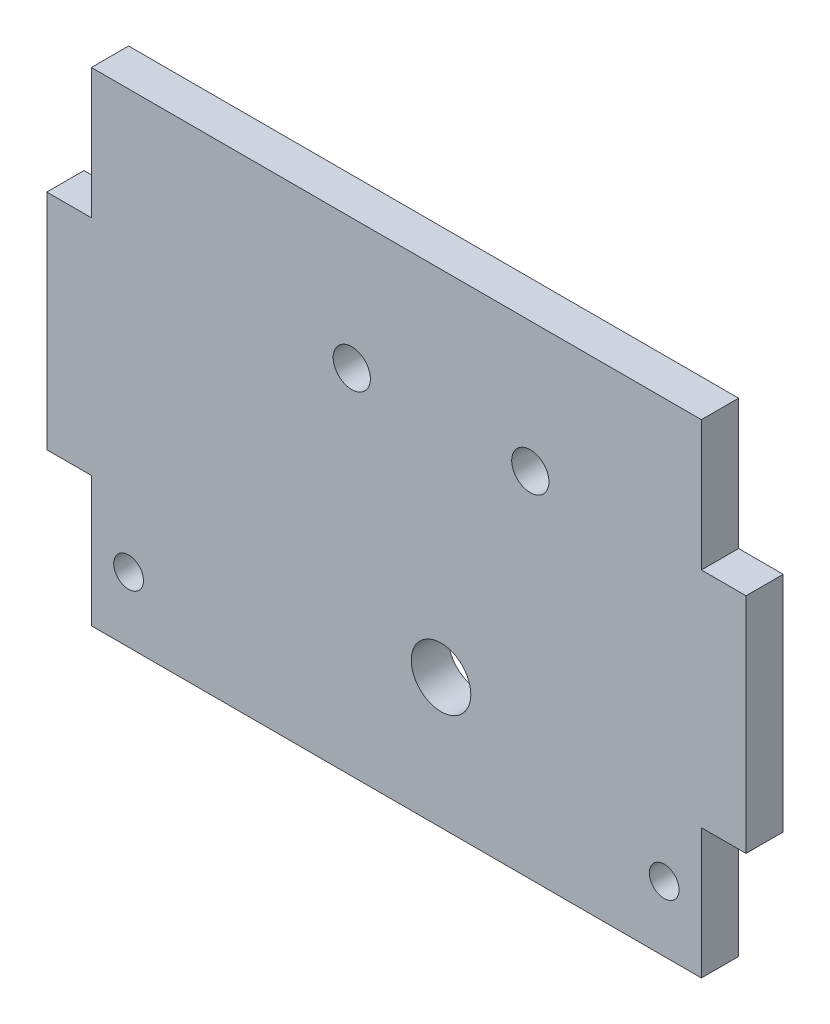
ISO-10303-21;
HEADER;
FILE_DESCRIPTION(('STEP AP214'),'2;1');
FILE_NAME('part.step','',(''),(''),'','','');
FILE_SCHEMA(('AUTOMOTIVE_DESIGN { 1 0 10303 214 1 1 1 1 }'));
ENDSEC;
DATA;
#1=APPLICATION_CONTEXT('core data for automotive mechanical design processes');
#2=APPLICATION_PROTOCOL_DEFINITION('international standard','automotive_design',2000,#1);
#3=PRODUCT_CONTEXT('',#1,'mechanical');
#4=PRODUCT('Part','Part','',(#3));
#5=PRODUCT_RELATED_PRODUCT_CATEGORY('part','',(#4));
#6=PRODUCT_DEFINITION_FORMATION('','',#4);
#7=PRODUCT_DEFINITION_CONTEXT('part definition',#1,'design');
#8=PRODUCT_DEFINITION('design','',#6,#7);
#9=PRODUCT_DEFINITION_SHAPE('','',#8);
#10=(LENGTH_UNIT() NAMED_UNIT(*) SI_UNIT(.MILLI.,.METRE.));
#11=(NAMED_UNIT(*) PLANE_ANGLE_UNIT() SI_UNIT($,.RADIAN.));
#12=(NAMED_UNIT(*) SI_UNIT($,.STERADIAN.) SOLID_ANGLE_UNIT());
#13=UNCERTAINTY_MEASURE_WITH_UNIT(LENGTH_MEASURE(1.E-05),#10,'distance_accuracy_value','');
#14=(GEOMETRIC_REPRESENTATION_CONTEXT(3) GLOBAL_UNCERTAINTY_ASSIGNED_CONTEXT((#13)) GLOBAL_UNIT_ASSIGNED_CONTEXT((#10,
#11,#12)) REPRESENTATION_CONTEXT('',''));
#15=CARTESIAN_POINT('',(0.,0.,0.));
#16=DIRECTION('',(0.,0.,1.));
#17=DIRECTION('',(1.,0.,0.));
#18=AXIS2_PLACEMENT_3D('',#15,#16,#17);
#19=CARTESIAN_POINT('',(0.,0.,5.));
#20=DIRECTION('',(0.,0.,-1.));
#21=DIRECTION('',(-1.,0.,0.));
#22=AXIS2_PLACEMENT_3D('',#19,#20,#21);
#23=PLANE('',#22);
#24=CARTESIAN_POINT('',(13.,47.5,5.));
#25=DIRECTION('',(0.,0.,1.));
#26=DIRECTION('',(1.,0.,0.));
#27=AXIS2_PLACEMENT_3D('',#24,#25,#26);
#28=CIRCLE('',#27,2.5);
#29=CARTESIAN_POINT('',(15.5,47.5,5.));
#30=VERTEX_POINT('',#29);
#31=EDGE_CURVE('E218',#30,#30,#28,.T.);
#32=ORIENTED_EDGE('',*,*,#31,.F.);
#33=EDGE_LOOP('',(#32));
#34=FACE_BOUND('',#33,.T.);
#35=CARTESIAN_POINT('',(37.,47.5,5.));
#36=DIRECTION('',(0.,0.,1.));
#37=DIRECTION('',(1.,0.,0.));
#38=AXIS2_PLACEMENT_3D('',#35,#36,#37);
#39=CIRCLE('',#38,2.5);
#40=CARTESIAN_POINT('',(39.5,47.5,5.));
#41=VERTEX_POINT('',#40);
#42=EDGE_CURVE('E223',#41,#41,#39,.T.);
#43=ORIENTED_EDGE('',*,*,#42,.F.);
#44=EDGE_LOOP('',(#43));
#45=FACE_BOUND('',#44,.T.);
#46=CARTESIAN_POINT('',(55.,8.74999999999999,5.));
#47=DIRECTION('',(0.,0.,1.));
#48=DIRECTION('',(1.,0.,0.));
#49=AXIS2_PLACEMENT_3D('',#46,#47,#48);
#50=CIRCLE('',#49,2.);
#51=CARTESIAN_POINT('',(57.,8.74999999999999,5.));
#52=VERTEX_POINT('',#51);
#53=EDGE_CURVE('E215',#52,#52,#50,.T.);
#54=ORIENTED_EDGE('',*,*,#53,.F.);
#55=EDGE_LOOP('',(#54));
#56=FACE_BOUND('',#55,.T.);
#57=DIRECTION('',(0.,-1.,0.));
#58=VECTOR('',#57,1.);
#59=CARTESIAN_POINT('',(60.,75.,5.));
#60=LINE('',#59,#58);
#61=CARTESIAN_POINT('',(60.,65.,5.));
#62=VERTEX_POINT('',#61);
#63=CARTESIAN_POINT('',(60.,47.5,5.));
#64=VERTEX_POINT('',#63);
#65=EDGE_CURVE('E154',#62,#64,#60,.T.);
#66=ORIENTED_EDGE('',*,*,#65,.F.);
#67=DIRECTION('',(1.,0.,0.));
#68=VECTOR('',#67,1.);
#69=CARTESIAN_POINT('',(60.,65.,5.));
#70=LINE('',#69,#68);
#71=CARTESIAN_POINT('',(-22.,65.,5.));
#72=VERTEX_POINT('',#71);
#73=EDGE_CURVE('E54',#72,#62,#70,.T.);
#74=ORIENTED_EDGE('',*,*,#73,.F.);
#75=DIRECTION('',(0.,-1.,0.));
#76=VECTOR('',#75,1.);
#77=CARTESIAN_POINT('',(-22.,65.,5.));
#78=LINE('',#77,#76);
#79=CARTESIAN_POINT('',(-22.,47.5,5.));
#80=VERTEX_POINT('',#79);
#81=EDGE_CURVE('E61',#72,#80,#78,.T.);
#82=ORIENTED_EDGE('',*,*,#81,.T.);
#83=DIRECTION('',(1.,0.,0.));
#84=VECTOR('',#83,1.);
#85=CARTESIAN_POINT('',(0.,47.5,5.));
#86=LINE('',#85,#84);
#87=CARTESIAN_POINT('',(-28.,47.5,5.));
#88=VERTEX_POINT('',#87);
#89=EDGE_CURVE('E179',#88,#80,#86,.T.);
#90=ORIENTED_EDGE('',*,*,#89,.F.);
#91=DIRECTION('',(0.,1.,0.));
#92=VECTOR('',#91,1.);
#93=CARTESIAN_POINT('',(-28.,0.,5.));
#94=LINE('',#93,#92);
#95=CARTESIAN_POINT('',(-28.,17.5,5.));
#96=VERTEX_POINT('',#95);
#97=EDGE_CURVE('E175',#96,#88,#94,.T.);
#98=ORIENTED_EDGE('',*,*,#97,.F.);
#99=DIRECTION('',(-1.,0.,0.));
#100=VECTOR('',#99,1.);
#101=CARTESIAN_POINT('',(0.,17.5,5.));
#102=LINE('',#101,#100);
#103=CARTESIAN_POINT('',(-22.,17.5,5.));
#104=VERTEX_POINT('',#103);
#105=EDGE_CURVE('E170',#104,#96,#102,.T.);
#106=ORIENTED_EDGE('',*,*,#105,.F.);
#107=CARTESIAN_POINT('',(-22.,0.,5.));
#108=VERTEX_POINT('',#107);
#109=EDGE_CURVE('E187',#104,#108,#78,.T.);
#110=ORIENTED_EDGE('',*,*,#109,.T.);
#111=DIRECTION('',(1.,0.,0.));
#112=VECTOR('',#111,1.);
#113=CARTESIAN_POINT('',(0.,0.,5.));
#114=LINE('',#113,#112);
#115=CARTESIAN_POINT('',(60.,0.,5.));
#116=VERTEX_POINT('',#115);
#117=EDGE_CURVE('E11',#108,#116,#114,.T.);
#118=ORIENTED_EDGE('',*,*,#117,.T.);
#119=DIRECTION('',(0.,-1.,0.));
#120=VECTOR('',#119,1.);
#121=CARTESIAN_POINT('',(60.,17.5,5.));
#122=LINE('',#121,#120);
#123=CARTESIAN_POINT('',(60.,17.5,5.));
#124=VERTEX_POINT('',#123);
#125=EDGE_CURVE('E149',#124,#116,#122,.T.);
#126=ORIENTED_EDGE('',*,*,#125,.F.);
#127=DIRECTION('',(-1.,0.,0.));
#128=VECTOR('',#127,1.);
#129=CARTESIAN_POINT('',(66.,17.5,5.));
#130=LINE('',#129,#128);
#131=CARTESIAN_POINT('',(66.,17.5,5.));
#132=VERTEX_POINT('',#131);
#133=EDGE_CURVE('E250',#132,#124,#130,.T.);
#134=ORIENTED_EDGE('',*,*,#133,.F.);
#135=DIRECTION('',(0.,-1.,0.));
#136=VECTOR('',#135,1.);
#137=CARTESIAN_POINT('',(66.,47.5,5.));
#138=LINE('',#137,#136);
#139=CARTESIAN_POINT('',(66.,47.5,5.));
#140=VERTEX_POINT('',#139);
#141=EDGE_CURVE('E214',#140,#132,#138,.T.);
#142=ORIENTED_EDGE('',*,*,#141,.F.);
#143=DIRECTION('',(-1.,0.,0.));
#144=VECTOR('',#143,1.);
#145=CARTESIAN_POINT('',(66.,47.5,5.));
#146=LINE('',#145,#144);
#147=EDGE_CURVE('E242',#140,#64,#146,.T.);
#148=ORIENTED_EDGE('',*,*,#147,.T.);
#149=EDGE_LOOP('',(#66,#74,#82,#90,#98,#106,#110,#118,#126,#134,#142,#148));
#150=FACE_BOUND('',#149,.T.);
#151=CARTESIAN_POINT('',(-17.,8.75,5.));
#152=DIRECTION('',(0.,0.,1.));
#153=DIRECTION('',(1.,0.,0.));
#154=AXIS2_PLACEMENT_3D('',#151,#152,#153);
#155=CIRCLE('',#154,2.);
#156=CARTESIAN_POINT('',(-15.,8.75,5.));
#157=VERTEX_POINT('',#156);
#158=EDGE_CURVE('E166',#157,#157,#155,.T.);
#159=ORIENTED_EDGE('',*,*,#158,.F.);
#160=EDGE_LOOP('',(#159));
#161=FACE_BOUND('',#160,.T.);
#162=CARTESIAN_POINT('',(25.,17.5,5.));
#163=DIRECTION('',(0.,0.,1.));
#164=DIRECTION('',(1.,0.,0.));
#165=AXIS2_PLACEMENT_3D('',#162,#163,#164);
#166=CIRCLE('',#165,4.);
#167=CARTESIAN_POINT('',(29.,17.5,5.));
#168=VERTEX_POINT('',#167);
#169=EDGE_CURVE('E204',#168,#168,#166,.T.);
#170=ORIENTED_EDGE('',*,*,#169,.F.);
#171=EDGE_LOOP('',(#170));
#172=FACE_BOUND('',#171,.T.);
#173=ADVANCED_FACE('F37',(#34,#45,#56,#150,#161,#172),#23,.F.);
#174=CARTESIAN_POINT('',(0.,0.,0.));
#175=DIRECTION('',(0.,0.,-1.));
#176=DIRECTION('',(-1.,0.,0.));
#177=AXIS2_PLACEMENT_3D('',#174,#175,#176);
#178=PLANE('',#177);
#179=CARTESIAN_POINT('',(13.,47.5,0.));
#180=DIRECTION('',(0.,0.,-1.));
#181=DIRECTION('',(-1.,0.,0.));
#182=AXIS2_PLACEMENT_3D('',#179,#180,#181);
#183=CIRCLE('',#182,2.5);
#184=CARTESIAN_POINT('',(10.5,47.5,0.));
#185=VERTEX_POINT('',#184);
#186=EDGE_CURVE('E41',#185,#185,#183,.T.);
#187=ORIENTED_EDGE('',*,*,#186,.F.);
#188=EDGE_LOOP('',(#187));
#189=FACE_BOUND('',#188,.T.);
#190=CARTESIAN_POINT('',(37.,47.5,0.));
#191=DIRECTION('',(0.,0.,-1.));
#192=DIRECTION('',(-1.,0.,0.));
#193=AXIS2_PLACEMENT_3D('',#190,#191,#192);
#194=CIRCLE('',#193,2.5);
#195=CARTESIAN_POINT('',(34.5,47.5,0.));
#196=VERTEX_POINT('',#195);
#197=EDGE_CURVE('E216',#196,#196,#194,.T.);
#198=ORIENTED_EDGE('',*,*,#197,.F.);
#199=EDGE_LOOP('',(#198));
#200=FACE_BOUND('',#199,.T.);
#201=DIRECTION('',(-1.,0.,0.));
#202=VECTOR('',#201,1.);
#203=CARTESIAN_POINT('',(60.,65.,0.));
#204=LINE('',#203,#202);
#205=CARTESIAN_POINT('',(60.,65.,0.));
#206=VERTEX_POINT('',#205);
#207=CARTESIAN_POINT('',(-22.,65.,0.));
#208=VERTEX_POINT('',#207);
#209=EDGE_CURVE('E128',#206,#208,#204,.T.);
#210=ORIENTED_EDGE('',*,*,#209,.F.);
#211=DIRECTION('',(0.,1.,0.));
#212=VECTOR('',#211,1.);
#213=CARTESIAN_POINT('',(60.,75.,0.));
#214=LINE('',#213,#212);
#215=CARTESIAN_POINT('',(60.,47.5,0.));
#216=VERTEX_POINT('',#215);
#217=EDGE_CURVE('E140',#216,#206,#214,.T.);
#218=ORIENTED_EDGE('',*,*,#217,.F.);
#219=DIRECTION('',(-1.,0.,0.));
#220=VECTOR('',#219,1.);
#221=CARTESIAN_POINT('',(66.,47.5,0.));
#222=LINE('',#221,#220);
#223=CARTESIAN_POINT('',(66.,47.5,0.));
#224=VERTEX_POINT('',#223);
#225=EDGE_CURVE('E245',#224,#216,#222,.T.);
#226=ORIENTED_EDGE('',*,*,#225,.F.);
#227=DIRECTION('',(0.,1.,0.));
#228=VECTOR('',#227,1.);
#229=CARTESIAN_POINT('',(66.,47.5,0.));
#230=LINE('',#229,#228);
#231=CARTESIAN_POINT('',(66.,17.5,0.));
#232=VERTEX_POINT('',#231);
#233=EDGE_CURVE('E238',#232,#224,#230,.T.);
#234=ORIENTED_EDGE('',*,*,#233,.F.);
#235=DIRECTION('',(-1.,0.,0.));
#236=VECTOR('',#235,1.);
#237=CARTESIAN_POINT('',(66.,17.5,0.));
#238=LINE('',#237,#236);
#239=CARTESIAN_POINT('',(60.,17.5,0.));
#240=VERTEX_POINT('',#239);
#241=EDGE_CURVE('E247',#232,#240,#238,.T.);
#242=ORIENTED_EDGE('',*,*,#241,.T.);
#243=DIRECTION('',(0.,1.,0.));
#244=VECTOR('',#243,1.);
#245=CARTESIAN_POINT('',(60.,17.5,0.));
#246=LINE('',#245,#244);
#247=CARTESIAN_POINT('',(60.,0.,0.));
#248=VERTEX_POINT('',#247);
#249=EDGE_CURVE('E160',#248,#240,#246,.T.);
#250=ORIENTED_EDGE('',*,*,#249,.F.);
#251=DIRECTION('',(1.,0.,0.));
#252=VECTOR('',#251,1.);
#253=CARTESIAN_POINT('',(0.,0.,0.));
#254=LINE('',#253,#252);
#255=CARTESIAN_POINT('',(-22.,0.,0.));
#256=VERTEX_POINT('',#255);
#257=EDGE_CURVE('E46',#256,#248,#254,.T.);
#258=ORIENTED_EDGE('',*,*,#257,.F.);
#259=DIRECTION('',(0.,-1.,0.));
#260=VECTOR('',#259,1.);
#261=CARTESIAN_POINT('',(-22.,65.,0.));
#262=LINE('',#261,#260);
#263=CARTESIAN_POINT('',(-22.,17.5,0.));
#264=VERTEX_POINT('',#263);
#265=EDGE_CURVE('E198',#264,#256,#262,.T.);
#266=ORIENTED_EDGE('',*,*,#265,.F.);
#267=DIRECTION('',(-1.,0.,0.));
#268=VECTOR('',#267,1.);
#269=CARTESIAN_POINT('',(0.,17.5,0.));
#270=LINE('',#269,#268);
#271=CARTESIAN_POINT('',(-28.,17.5,0.));
#272=VERTEX_POINT('',#271);
#273=EDGE_CURVE('E184',#264,#272,#270,.T.);
#274=ORIENTED_EDGE('',*,*,#273,.T.);
#275=DIRECTION('',(0.,1.,0.));
#276=VECTOR('',#275,1.);
#277=CARTESIAN_POINT('',(-28.,0.,0.));
#278=LINE('',#277,#276);
#279=CARTESIAN_POINT('',(-28.,47.5,0.));
#280=VERTEX_POINT('',#279);
#281=EDGE_CURVE('E178',#272,#280,#278,.T.);
#282=ORIENTED_EDGE('',*,*,#281,.T.);
#283=DIRECTION('',(1.,0.,0.));
#284=VECTOR('',#283,1.);
#285=CARTESIAN_POINT('',(0.,47.5,0.));
#286=LINE('',#285,#284);
#287=CARTESIAN_POINT('',(-22.,47.5,0.));
#288=VERTEX_POINT('',#287);
#289=EDGE_CURVE('E188',#280,#288,#286,.T.);
#290=ORIENTED_EDGE('',*,*,#289,.T.);
#291=EDGE_CURVE('E142',#208,#288,#262,.T.);
#292=ORIENTED_EDGE('',*,*,#291,.F.);
#293=EDGE_LOOP('',(#210,#218,#226,#234,#242,#250,#258,#266,#274,#282,#290,#292));
#294=FACE_BOUND('',#293,.T.);
#295=CARTESIAN_POINT('',(55.,8.74999999999999,0.));
#296=DIRECTION('',(0.,0.,-1.));
#297=DIRECTION('',(-1.,0.,0.));
#298=AXIS2_PLACEMENT_3D('',#295,#296,#297);
#299=CIRCLE('',#298,2.);
#300=CARTESIAN_POINT('',(53.,8.74999999999999,0.));
#301=VERTEX_POINT('',#300);
#302=EDGE_CURVE('E212',#301,#301,#299,.T.);
#303=ORIENTED_EDGE('',*,*,#302,.F.);
#304=EDGE_LOOP('',(#303));
#305=FACE_BOUND('',#304,.T.);
#306=CARTESIAN_POINT('',(-17.,8.75,0.));
#307=DIRECTION('',(0.,0.,-1.));
#308=DIRECTION('',(-1.,0.,0.));
#309=AXIS2_PLACEMENT_3D('',#306,#307,#308);
#310=CIRCLE('',#309,2.);
#311=CARTESIAN_POINT('',(-19.,8.75,0.));
#312=VERTEX_POINT('',#311);
#313=EDGE_CURVE('E169',#312,#312,#310,.T.);
#314=ORIENTED_EDGE('',*,*,#313,.F.);
#315=EDGE_LOOP('',(#314));
#316=FACE_BOUND('',#315,.T.);
#317=CARTESIAN_POINT('',(25.,17.5,0.));
#318=DIRECTION('',(0.,0.,1.));
#319=DIRECTION('',(1.,0.,0.));
#320=AXIS2_PLACEMENT_3D('',#317,#318,#319);
#321=CIRCLE('',#320,4.);
#322=CARTESIAN_POINT('',(29.,17.5,0.));
#323=VERTEX_POINT('',#322);
#324=EDGE_CURVE('E203',#323,#323,#321,.T.);
#325=ORIENTED_EDGE('',*,*,#324,.T.);
#326=EDGE_LOOP('',(#325));
#327=FACE_BOUND('',#326,.T.);
#328=ADVANCED_FACE('F137',(#189,#200,#294,#305,#316,#327),#178,.T.);
#329=CARTESIAN_POINT('',(-22.,65.,-65.00769185258));
#330=DIRECTION('',(-1.,0.,0.));
#331=DIRECTION('',(0.,0.,1.));
#332=AXIS2_PLACEMENT_3D('',#329,#330,#331);
#333=PLANE('',#332);
#334=DIRECTION('',(0.,0.,1.));
#335=VECTOR('',#334,1.);
#336=CARTESIAN_POINT('',(-22.,65.,0.));
#337=LINE('',#336,#335);
#338=EDGE_CURVE('E143',#208,#72,#337,.T.);
#339=ORIENTED_EDGE('',*,*,#338,.F.);
#340=ORIENTED_EDGE('',*,*,#291,.T.);
#341=DIRECTION('',(0.,0.,1.));
#342=VECTOR('',#341,1.);
#343=CARTESIAN_POINT('',(-22.,47.5,-30.5941170815567));
#344=LINE('',#343,#342);
#345=EDGE_CURVE('E182',#288,#80,#344,.T.);
#346=ORIENTED_EDGE('',*,*,#345,.T.);
#347=ORIENTED_EDGE('',*,*,#81,.F.);
#348=EDGE_LOOP('',(#339,#340,#346,#347));
#349=FACE_BOUND('',#348,.T.);
#350=ADVANCED_FACE('F287',(#349),#333,.T.);
#351=CARTESIAN_POINT('',(0.,0.,5.));
#352=DIRECTION('',(0.,1.,0.));
#353=DIRECTION('',(0.,0.,1.));
#354=AXIS2_PLACEMENT_3D('',#351,#352,#353);
#355=PLANE('',#354);
#356=ORIENTED_EDGE('',*,*,#257,.T.);
#357=DIRECTION('',(0.,0.,-1.));
#358=VECTOR('',#357,1.);
#359=CARTESIAN_POINT('',(60.,0.,5.));
#360=LINE('',#359,#358);
#361=EDGE_CURVE('E152',#116,#248,#360,.T.);
#362=ORIENTED_EDGE('',*,*,#361,.F.);
#363=ORIENTED_EDGE('',*,*,#117,.F.);
#364=DIRECTION('',(0.,0.,1.));
#365=VECTOR('',#364,1.);
#366=CARTESIAN_POINT('',(-22.,0.,-65.00769185258));
#367=LINE('',#366,#365);
#368=EDGE_CURVE('E200',#256,#108,#367,.T.);
#369=ORIENTED_EDGE('',*,*,#368,.F.);
#370=EDGE_LOOP('',(#356,#362,#363,#369));
#371=FACE_BOUND('',#370,.T.);
#372=ADVANCED_FACE('F39',(#371),#355,.F.);
#373=CARTESIAN_POINT('',(25.,17.5,5.));
#374=DIRECTION('',(0.,0.,-1.));
#375=DIRECTION('',(-1.,0.,0.));
#376=AXIS2_PLACEMENT_3D('',#373,#374,#375);
#377=CYLINDRICAL_SURFACE('',#376,4.);
#378=ORIENTED_EDGE('',*,*,#169,.T.);
#379=EDGE_LOOP('',(#378));
#380=FACE_BOUND('',#379,.T.);
#381=ORIENTED_EDGE('',*,*,#324,.F.);
#382=EDGE_LOOP('',(#381));
#383=FACE_BOUND('',#382,.T.);
#384=ADVANCED_FACE('F296',(#380,#383),#377,.F.);
#385=DIRECTION('',(0.,0.,1.));
#386=VECTOR('',#385,1.);
#387=CARTESIAN_POINT('',(-22.,17.5,-30.5941170815567));
#388=LINE('',#387,#386);
#389=EDGE_CURVE('E174',#264,#104,#388,.T.);
#390=ORIENTED_EDGE('',*,*,#389,.F.);
#391=ORIENTED_EDGE('',*,*,#265,.T.);
#392=ORIENTED_EDGE('',*,*,#368,.T.);
#393=ORIENTED_EDGE('',*,*,#109,.F.);
#394=EDGE_LOOP('',(#390,#391,#392,#393));
#395=FACE_BOUND('',#394,.T.);
#396=ADVANCED_FACE('F290',(#395),#333,.T.);
#397=CARTESIAN_POINT('',(0.,47.5,-30.5941170815567));
#398=DIRECTION('',(0.,-1.,0.));
#399=DIRECTION('',(0.,0.,-1.));
#400=AXIS2_PLACEMENT_3D('',#397,#398,#399);
#401=PLANE('',#400);
#402=ORIENTED_EDGE('',*,*,#289,.F.);
#403=DIRECTION('',(0.,0.,1.));
#404=VECTOR('',#403,1.);
#405=CARTESIAN_POINT('',(-28.,47.5,-30.5941170815567));
#406=LINE('',#405,#404);
#407=EDGE_CURVE('E183',#280,#88,#406,.T.);
#408=ORIENTED_EDGE('',*,*,#407,.T.);
#409=ORIENTED_EDGE('',*,*,#89,.T.);
#410=ORIENTED_EDGE('',*,*,#345,.F.);
#411=EDGE_LOOP('',(#402,#408,#409,#410));
#412=FACE_BOUND('',#411,.T.);
#413=ADVANCED_FACE('F285',(#412),#401,.F.);
#414=CARTESIAN_POINT('',(0.,17.5,-30.5941170815567));
#415=DIRECTION('',(0.,1.,0.));
#416=DIRECTION('',(0.,0.,1.));
#417=AXIS2_PLACEMENT_3D('',#414,#415,#416);
#418=PLANE('',#417);
#419=ORIENTED_EDGE('',*,*,#273,.F.);
#420=ORIENTED_EDGE('',*,*,#389,.T.);
#421=ORIENTED_EDGE('',*,*,#105,.T.);
#422=DIRECTION('',(0.,0.,1.));
#423=VECTOR('',#422,1.);
#424=CARTESIAN_POINT('',(-28.,17.5,-30.5941170815567));
#425=LINE('',#424,#423);
#426=EDGE_CURVE('E173',#272,#96,#425,.T.);
#427=ORIENTED_EDGE('',*,*,#426,.F.);
#428=EDGE_LOOP('',(#419,#420,#421,#427));
#429=FACE_BOUND('',#428,.T.);
#430=ADVANCED_FACE('F276',(#429),#418,.F.);
#431=CARTESIAN_POINT('',(-28.,0.,-30.5941170815567));
#432=DIRECTION('',(1.,0.,0.));
#433=DIRECTION('',(0.,0.,-1.));
#434=AXIS2_PLACEMENT_3D('',#431,#432,#433);
#435=PLANE('',#434);
#436=ORIENTED_EDGE('',*,*,#281,.F.);
#437=ORIENTED_EDGE('',*,*,#426,.T.);
#438=ORIENTED_EDGE('',*,*,#97,.T.);
#439=ORIENTED_EDGE('',*,*,#407,.F.);
#440=EDGE_LOOP('',(#436,#437,#438,#439));
#441=FACE_BOUND('',#440,.T.);
#442=ADVANCED_FACE('F281',(#441),#435,.F.);
#443=CARTESIAN_POINT('',(-17.,8.75,-5.));
#444=DIRECTION('',(0.,0.,1.));
#445=DIRECTION('',(1.,0.,0.));
#446=AXIS2_PLACEMENT_3D('',#443,#444,#445);
#447=CYLINDRICAL_SURFACE('',#446,2.);
#448=ORIENTED_EDGE('',*,*,#313,.T.);
#449=EDGE_LOOP('',(#448));
#450=FACE_BOUND('',#449,.T.);
#451=ORIENTED_EDGE('',*,*,#158,.T.);
#452=EDGE_LOOP('',(#451));
#453=FACE_BOUND('',#452,.T.);
#454=ADVANCED_FACE('F339',(#450,#453),#447,.F.);
#455=CARTESIAN_POINT('',(60.,0.,0.));
#456=DIRECTION('',(1.,0.,0.));
#457=DIRECTION('',(0.,0.,-1.));
#458=AXIS2_PLACEMENT_3D('',#455,#456,#457);
#459=PLANE('',#458);
#460=ORIENTED_EDGE('',*,*,#125,.T.);
#461=ORIENTED_EDGE('',*,*,#361,.T.);
#462=ORIENTED_EDGE('',*,*,#249,.T.);
#463=DIRECTION('',(0.,0.,1.));
#464=VECTOR('',#463,1.);
#465=CARTESIAN_POINT('',(60.,17.5,5.));
#466=LINE('',#465,#464);
#467=EDGE_CURVE('E163',#240,#124,#466,.T.);
#468=ORIENTED_EDGE('',*,*,#467,.T.);
#469=EDGE_LOOP('',(#460,#461,#462,#468));
#470=FACE_BOUND('',#469,.T.);
#471=ADVANCED_FACE('F267',(#470),#459,.T.);
#472=CARTESIAN_POINT('',(60.,0.,0.));
#473=DIRECTION('',(1.,0.,0.));
#474=DIRECTION('',(0.,0.,-1.));
#475=AXIS2_PLACEMENT_3D('',#472,#473,#474);
#476=PLANE('',#475);
#477=DIRECTION('',(0.,0.,-1.));
#478=VECTOR('',#477,1.);
#479=CARTESIAN_POINT('',(60.,65.,0.));
#480=LINE('',#479,#478);
#481=EDGE_CURVE('E125',#62,#206,#480,.T.);
#482=ORIENTED_EDGE('',*,*,#481,.F.);
#483=ORIENTED_EDGE('',*,*,#65,.T.);
#484=DIRECTION('',(0.,0.,-1.));
#485=VECTOR('',#484,1.);
#486=CARTESIAN_POINT('',(60.,47.5,5.));
#487=LINE('',#486,#485);
#488=EDGE_CURVE('E148',#64,#216,#487,.T.);
#489=ORIENTED_EDGE('',*,*,#488,.T.);
#490=ORIENTED_EDGE('',*,*,#217,.T.);
#491=EDGE_LOOP('',(#482,#483,#489,#490));
#492=FACE_BOUND('',#491,.T.);
#493=ADVANCED_FACE('F146',(#492),#476,.T.);
#494=CARTESIAN_POINT('',(66.,17.5,5.));
#495=DIRECTION('',(0.,1.,0.));
#496=DIRECTION('',(0.,0.,1.));
#497=AXIS2_PLACEMENT_3D('',#494,#495,#496);
#498=PLANE('',#497);
#499=ORIENTED_EDGE('',*,*,#467,.F.);
#500=ORIENTED_EDGE('',*,*,#241,.F.);
#501=DIRECTION('',(0.,0.,-1.));
#502=VECTOR('',#501,1.);
#503=CARTESIAN_POINT('',(66.,17.5,5.));
#504=LINE('',#503,#502);
#505=EDGE_CURVE('E236',#132,#232,#504,.T.);
#506=ORIENTED_EDGE('',*,*,#505,.F.);
#507=ORIENTED_EDGE('',*,*,#133,.T.);
#508=EDGE_LOOP('',(#499,#500,#506,#507));
#509=FACE_BOUND('',#508,.T.);
#510=ADVANCED_FACE('F371',(#509),#498,.F.);
#511=CARTESIAN_POINT('',(66.,47.5,5.));
#512=DIRECTION('',(0.,-1.,0.));
#513=DIRECTION('',(0.,0.,-1.));
#514=AXIS2_PLACEMENT_3D('',#511,#512,#513);
#515=PLANE('',#514);
#516=ORIENTED_EDGE('',*,*,#488,.F.);
#517=ORIENTED_EDGE('',*,*,#147,.F.);
#518=DIRECTION('',(0.,0.,1.));
#519=VECTOR('',#518,1.);
#520=CARTESIAN_POINT('',(66.,47.5,5.));
#521=LINE('',#520,#519);
#522=EDGE_CURVE('E240',#224,#140,#521,.T.);
#523=ORIENTED_EDGE('',*,*,#522,.F.);
#524=ORIENTED_EDGE('',*,*,#225,.T.);
#525=EDGE_LOOP('',(#516,#517,#523,#524));
#526=FACE_BOUND('',#525,.T.);
#527=ADVANCED_FACE('F253',(#526),#515,.F.);
#528=CARTESIAN_POINT('',(66.,0.,0.));
#529=DIRECTION('',(1.,0.,0.));
#530=DIRECTION('',(0.,0.,-1.));
#531=AXIS2_PLACEMENT_3D('',#528,#529,#530);
#532=PLANE('',#531);
#533=ORIENTED_EDGE('',*,*,#141,.T.);
#534=ORIENTED_EDGE('',*,*,#505,.T.);
#535=ORIENTED_EDGE('',*,*,#233,.T.);
#536=ORIENTED_EDGE('',*,*,#522,.T.);
#537=EDGE_LOOP('',(#533,#534,#535,#536));
#538=FACE_BOUND('',#537,.T.);
#539=ADVANCED_FACE('F260',(#538),#532,.T.);
#540=CARTESIAN_POINT('',(55.,8.74999999999999,-5.));
#541=DIRECTION('',(0.,0.,1.));
#542=DIRECTION('',(1.,0.,0.));
#543=AXIS2_PLACEMENT_3D('',#540,#541,#542);
#544=CYLINDRICAL_SURFACE('',#543,2.);
#545=ORIENTED_EDGE('',*,*,#302,.T.);
#546=EDGE_LOOP('',(#545));
#547=FACE_BOUND('',#546,.T.);
#548=ORIENTED_EDGE('',*,*,#53,.T.);
#549=EDGE_LOOP('',(#548));
#550=FACE_BOUND('',#549,.T.);
#551=ADVANCED_FACE('F392',(#547,#550),#544,.F.);
#552=CARTESIAN_POINT('',(0.,65.,0.));
#553=DIRECTION('',(0.,-1.,0.));
#554=DIRECTION('',(0.,0.,-1.));
#555=AXIS2_PLACEMENT_3D('',#552,#553,#554);
#556=PLANE('',#555);
#557=ORIENTED_EDGE('',*,*,#481,.T.);
#558=ORIENTED_EDGE('',*,*,#209,.T.);
#559=ORIENTED_EDGE('',*,*,#338,.T.);
#560=ORIENTED_EDGE('',*,*,#73,.T.);
#561=EDGE_LOOP('',(#557,#558,#559,#560));
#562=FACE_BOUND('',#561,.T.);
#563=ADVANCED_FACE('F127',(#562),#556,.F.);
#564=CARTESIAN_POINT('',(37.,47.5,-5.));
#565=DIRECTION('',(0.,0.,1.));
#566=DIRECTION('',(1.,0.,0.));
#567=AXIS2_PLACEMENT_3D('',#564,#565,#566);
#568=CYLINDRICAL_SURFACE('',#567,2.5);
#569=ORIENTED_EDGE('',*,*,#197,.T.);
#570=EDGE_LOOP('',(#569));
#571=FACE_BOUND('',#570,.T.);
#572=ORIENTED_EDGE('',*,*,#42,.T.);
#573=EDGE_LOOP('',(#572));
#574=FACE_BOUND('',#573,.T.);
#575=ADVANCED_FACE('F414',(#571,#574),#568,.F.);
#576=CARTESIAN_POINT('',(13.,47.5,-5.));
#577=DIRECTION('',(0.,0.,1.));
#578=DIRECTION('',(1.,0.,0.));
#579=AXIS2_PLACEMENT_3D('',#576,#577,#578);
#580=CYLINDRICAL_SURFACE('',#579,2.5);
#581=ORIENTED_EDGE('',*,*,#186,.T.);
#582=EDGE_LOOP('',(#581));
#583=FACE_BOUND('',#582,.T.);
#584=ORIENTED_EDGE('',*,*,#31,.T.);
#585=EDGE_LOOP('',(#584));
#586=FACE_BOUND('',#585,.T.);
#587=ADVANCED_FACE('F438',(#583,#586),#580,.F.);
#588=CLOSED_SHELL('',(#173,#328,#350,#372,#384,#396,#413,#430,#442,#454,#471,#493,#510,#527,
#539,#551,#563,#575,#587));
#589=MANIFOLD_SOLID_BREP('B2',#588);
#590=ADVANCED_BREP_SHAPE_REPRESENTATION('',(#18,#589),#14);
#591=SHAPE_DEFINITION_REPRESENTATION(#9,#590);
ENDSEC;
END-ISO-10303-21;
